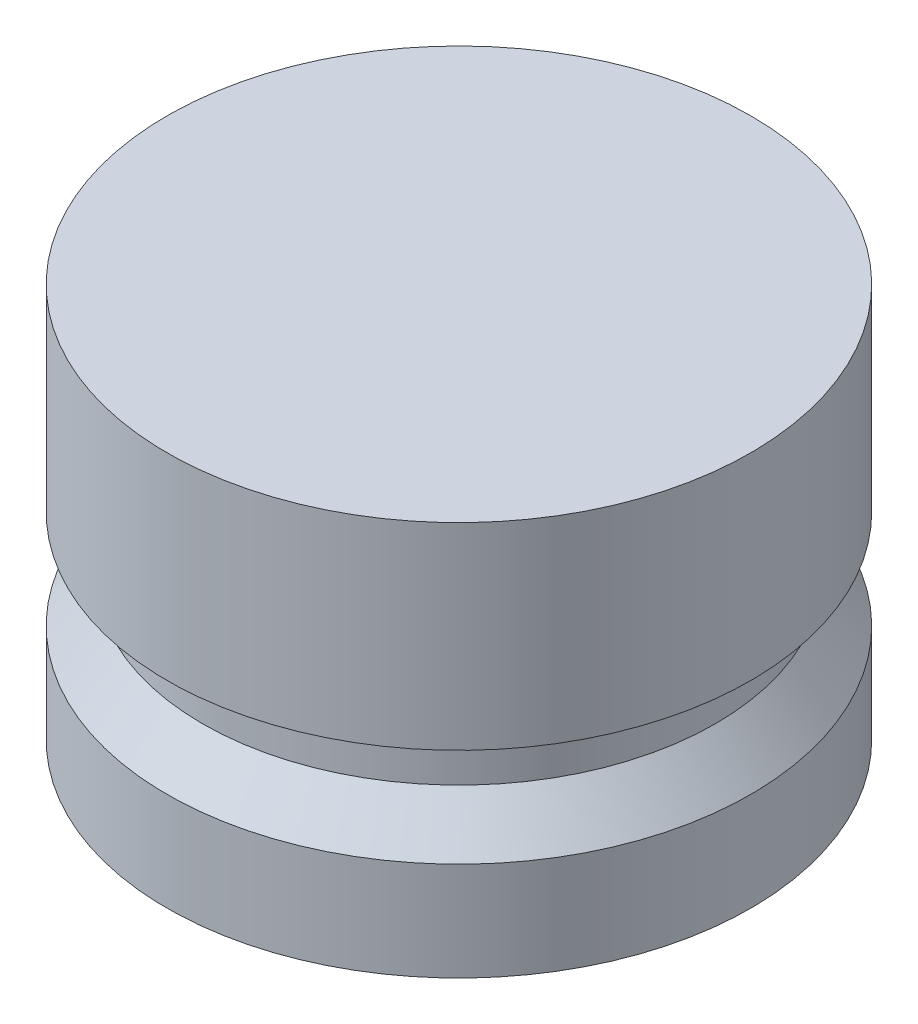
ISO-10303-21;
HEADER;
FILE_DESCRIPTION(('STEP AP214'),'2;1');
FILE_NAME('part.step','',(''),(''),'','','');
FILE_SCHEMA(('AUTOMOTIVE_DESIGN { 1 0 10303 214 1 1 1 1 }'));
ENDSEC;
DATA;
#1=APPLICATION_CONTEXT('core data for automotive mechanical design processes');
#2=APPLICATION_PROTOCOL_DEFINITION('international standard','automotive_design',2000,#1);
#3=PRODUCT_CONTEXT('',#1,'mechanical');
#4=PRODUCT('Part','Part','',(#3));
#5=PRODUCT_RELATED_PRODUCT_CATEGORY('part','',(#4));
#6=PRODUCT_DEFINITION_FORMATION('','',#4);
#7=PRODUCT_DEFINITION_CONTEXT('part definition',#1,'design');
#8=PRODUCT_DEFINITION('design','',#6,#7);
#9=PRODUCT_DEFINITION_SHAPE('','',#8);
#10=(LENGTH_UNIT() NAMED_UNIT(*) SI_UNIT(.MILLI.,.METRE.));
#11=(NAMED_UNIT(*) PLANE_ANGLE_UNIT() SI_UNIT($,.RADIAN.));
#12=(NAMED_UNIT(*) SI_UNIT($,.STERADIAN.) SOLID_ANGLE_UNIT());
#13=UNCERTAINTY_MEASURE_WITH_UNIT(LENGTH_MEASURE(1.E-05),#10,'distance_accuracy_value','');
#14=(GEOMETRIC_REPRESENTATION_CONTEXT(3) GLOBAL_UNCERTAINTY_ASSIGNED_CONTEXT((#13)) GLOBAL_UNIT_ASSIGNED_CONTEXT((#10,
#11,#12)) REPRESENTATION_CONTEXT('',''));
#15=CARTESIAN_POINT('',(0.,0.,0.));
#16=DIRECTION('',(0.,0.,1.));
#17=DIRECTION('',(1.,0.,0.));
#18=AXIS2_PLACEMENT_3D('',#15,#16,#17);
#19=CARTESIAN_POINT('',(0.,0.,0.));
#20=DIRECTION('',(0.,1.,0.));
#21=DIRECTION('',(0.,0.,1.));
#22=AXIS2_PLACEMENT_3D('',#19,#20,#21);
#23=PLANE('',#22);
#24=CARTESIAN_POINT('',(0.,0.,0.));
#25=DIRECTION('',(0.,-1.,0.));
#26=DIRECTION('',(0.,0.,-1.));
#27=AXIS2_PLACEMENT_3D('',#24,#25,#26);
#28=CIRCLE('',#27,9.398);
#29=CARTESIAN_POINT('',(0.,0.,-9.398));
#30=VERTEX_POINT('',#29);
#31=EDGE_CURVE('E10',#30,#30,#28,.T.);
#32=ORIENTED_EDGE('',*,*,#31,.T.);
#33=EDGE_LOOP('',(#32));
#34=FACE_BOUND('',#33,.T.);
#35=ADVANCED_FACE('F31',(#34),#23,.F.);
#36=CARTESIAN_POINT('',(0.,0.,0.));
#37=DIRECTION('',(0.,-1.,0.));
#38=DIRECTION('',(0.,0.,-1.));
#39=AXIS2_PLACEMENT_3D('',#36,#37,#38);
#40=CYLINDRICAL_SURFACE('',#39,9.398);
#41=ORIENTED_EDGE('',*,*,#31,.F.);
#42=EDGE_LOOP('',(#41));
#43=FACE_BOUND('',#42,.T.);
#44=CARTESIAN_POINT('',(0.,3.175,0.));
#45=DIRECTION('',(0.,-1.,0.));
#46=DIRECTION('',(0.,0.,-1.));
#47=AXIS2_PLACEMENT_3D('',#44,#45,#46);
#48=CIRCLE('',#47,9.398);
#49=CARTESIAN_POINT('',(0.,3.175,-9.398));
#50=VERTEX_POINT('',#49);
#51=EDGE_CURVE('E37',#50,#50,#48,.T.);
#52=ORIENTED_EDGE('',*,*,#51,.T.);
#53=EDGE_LOOP('',(#52));
#54=FACE_BOUND('',#53,.T.);
#55=ADVANCED_FACE('F69',(#43,#54),#40,.T.);
#56=CARTESIAN_POINT('',(0.,4.572,0.));
#57=DIRECTION('',(0.,-1.,0.));
#58=DIRECTION('',(0.,0.,-1.));
#59=AXIS2_PLACEMENT_3D('',#56,#57,#58);
#60=CONICAL_SURFACE('',#59,8.255,0.685729510906286);
#61=ORIENTED_EDGE('',*,*,#51,.F.);
#62=EDGE_LOOP('',(#61));
#63=FACE_BOUND('',#62,.T.);
#64=CARTESIAN_POINT('',(0.,4.572,0.));
#65=DIRECTION('',(0.,-1.,0.));
#66=DIRECTION('',(0.,0.,-1.));
#67=AXIS2_PLACEMENT_3D('',#64,#65,#66);
#68=CIRCLE('',#67,8.255);
#69=CARTESIAN_POINT('',(0.,4.572,-8.255));
#70=VERTEX_POINT('',#69);
#71=EDGE_CURVE('E41',#70,#70,#68,.T.);
#72=ORIENTED_EDGE('',*,*,#71,.T.);
#73=EDGE_LOOP('',(#72));
#74=FACE_BOUND('',#73,.T.);
#75=ADVANCED_FACE('F73',(#63,#74),#60,.T.);
#76=CARTESIAN_POINT('',(0.,0.,0.));
#77=DIRECTION('',(0.,-1.,0.));
#78=DIRECTION('',(0.,0.,-1.));
#79=AXIS2_PLACEMENT_3D('',#76,#77,#78);
#80=CYLINDRICAL_SURFACE('',#79,8.255);
#81=ORIENTED_EDGE('',*,*,#71,.F.);
#82=EDGE_LOOP('',(#81));
#83=FACE_BOUND('',#82,.T.);
#84=CARTESIAN_POINT('',(0.,6.35,0.));
#85=DIRECTION('',(0.,-1.,0.));
#86=DIRECTION('',(0.,0.,-1.));
#87=AXIS2_PLACEMENT_3D('',#84,#85,#86);
#88=CIRCLE('',#87,8.255);
#89=CARTESIAN_POINT('',(0.,6.35,-8.255));
#90=VERTEX_POINT('',#89);
#91=EDGE_CURVE('E45',#90,#90,#88,.T.);
#92=ORIENTED_EDGE('',*,*,#91,.T.);
#93=EDGE_LOOP('',(#92));
#94=FACE_BOUND('',#93,.T.);
#95=ADVANCED_FACE('F78',(#83,#94),#80,.T.);
#96=CARTESIAN_POINT('',(-8.255,6.35,0.));
#97=DIRECTION('',(0.,1.,0.));
#98=DIRECTION('',(0.,0.,1.));
#99=AXIS2_PLACEMENT_3D('',#96,#97,#98);
#100=PLANE('',#99);
#101=ORIENTED_EDGE('',*,*,#91,.F.);
#102=EDGE_LOOP('',(#101));
#103=FACE_BOUND('',#102,.T.);
#104=CARTESIAN_POINT('',(0.,6.35,0.));
#105=DIRECTION('',(0.,-1.,0.));
#106=DIRECTION('',(0.,0.,-1.));
#107=AXIS2_PLACEMENT_3D('',#104,#105,#106);
#108=CIRCLE('',#107,9.398);
#109=CARTESIAN_POINT('',(0.,6.35,-9.398));
#110=VERTEX_POINT('',#109);
#111=EDGE_CURVE('E50',#110,#110,#108,.T.);
#112=ORIENTED_EDGE('',*,*,#111,.T.);
#113=EDGE_LOOP('',(#112));
#114=FACE_BOUND('',#113,.T.);
#115=ADVANCED_FACE('F65',(#103,#114),#100,.F.);
#116=CARTESIAN_POINT('',(0.,0.,0.));
#117=DIRECTION('',(0.,-1.,0.));
#118=DIRECTION('',(0.,0.,-1.));
#119=AXIS2_PLACEMENT_3D('',#116,#117,#118);
#120=CYLINDRICAL_SURFACE('',#119,9.398);
#121=ORIENTED_EDGE('',*,*,#111,.F.);
#122=EDGE_LOOP('',(#121));
#123=FACE_BOUND('',#122,.T.);
#124=CARTESIAN_POINT('',(0.,12.7,0.));
#125=DIRECTION('',(0.,-1.,0.));
#126=DIRECTION('',(0.,0.,-1.));
#127=AXIS2_PLACEMENT_3D('',#124,#125,#126);
#128=CIRCLE('',#127,9.398);
#129=CARTESIAN_POINT('',(0.,12.7,-9.398));
#130=VERTEX_POINT('',#129);
#131=EDGE_CURVE('E53',#130,#130,#128,.T.);
#132=ORIENTED_EDGE('',*,*,#131,.T.);
#133=EDGE_LOOP('',(#132));
#134=FACE_BOUND('',#133,.T.);
#135=ADVANCED_FACE('F57',(#123,#134),#120,.T.);
#136=CARTESIAN_POINT('',(-9.398,12.7,0.));
#137=DIRECTION('',(0.,-1.,0.));
#138=DIRECTION('',(0.,0.,-1.));
#139=AXIS2_PLACEMENT_3D('',#136,#137,#138);
#140=PLANE('',#139);
#141=ORIENTED_EDGE('',*,*,#131,.F.);
#142=EDGE_LOOP('',(#141));
#143=FACE_BOUND('',#142,.T.);
#144=ADVANCED_FACE('F59',(#143),#140,.F.);
#145=CLOSED_SHELL('',(#35,#55,#75,#95,#115,#135,#144));
#146=MANIFOLD_SOLID_BREP('B2',#145);
#147=ADVANCED_BREP_SHAPE_REPRESENTATION('',(#18,#146),#14);
#148=SHAPE_DEFINITION_REPRESENTATION(#9,#147);
ENDSEC;
END-ISO-10303-21;
